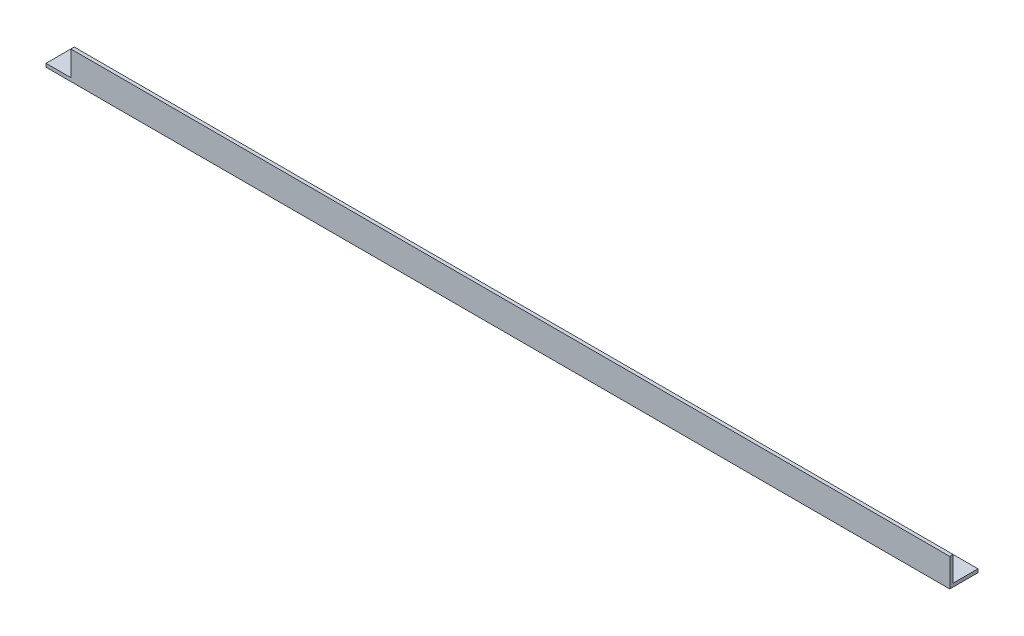
ISO-10303-21;
HEADER;
FILE_DESCRIPTION(('STEP AP214'),'2;1');
FILE_NAME('part.step','',(''),(''),'','','');
FILE_SCHEMA(('AUTOMOTIVE_DESIGN { 1 0 10303 214 1 1 1 1 }'));
ENDSEC;
DATA;
#1=APPLICATION_CONTEXT('core data for automotive mechanical design processes');
#2=APPLICATION_PROTOCOL_DEFINITION('international standard','automotive_design',2000,#1);
#3=PRODUCT_CONTEXT('',#1,'mechanical');
#4=PRODUCT('Part','Part','',(#3));
#5=PRODUCT_RELATED_PRODUCT_CATEGORY('part','',(#4));
#6=PRODUCT_DEFINITION_FORMATION('','',#4);
#7=PRODUCT_DEFINITION_CONTEXT('part definition',#1,'design');
#8=PRODUCT_DEFINITION('design','',#6,#7);
#9=PRODUCT_DEFINITION_SHAPE('','',#8);
#10=(LENGTH_UNIT() NAMED_UNIT(*) SI_UNIT(.MILLI.,.METRE.));
#11=(NAMED_UNIT(*) PLANE_ANGLE_UNIT() SI_UNIT($,.RADIAN.));
#12=(NAMED_UNIT(*) SI_UNIT($,.STERADIAN.) SOLID_ANGLE_UNIT());
#13=UNCERTAINTY_MEASURE_WITH_UNIT(LENGTH_MEASURE(1.E-05),#10,'distance_accuracy_value','');
#14=(GEOMETRIC_REPRESENTATION_CONTEXT(3) GLOBAL_UNCERTAINTY_ASSIGNED_CONTEXT((#13)) GLOBAL_UNIT_ASSIGNED_CONTEXT((#10,
#11,#12)) REPRESENTATION_CONTEXT('',''));
#15=CARTESIAN_POINT('',(0.,0.,0.));
#16=DIRECTION('',(0.,0.,1.));
#17=DIRECTION('',(1.,0.,0.));
#18=AXIS2_PLACEMENT_3D('',#15,#16,#17);
#19=CARTESIAN_POINT('',(800.,0.,-3.));
#20=DIRECTION('',(0.,0.,1.));
#21=DIRECTION('',(1.,0.,0.));
#22=AXIS2_PLACEMENT_3D('',#19,#20,#21);
#23=PLANE('',#22);
#24=DIRECTION('',(-1.,0.,0.));
#25=VECTOR('',#24,1.);
#26=CARTESIAN_POINT('',(800.,3.,-3.));
#27=LINE('',#26,#25);
#28=CARTESIAN_POINT('',(800.,3.,-3.));
#29=VERTEX_POINT('',#28);
#30=CARTESIAN_POINT('',(22.,3.,-3.));
#31=VERTEX_POINT('',#30);
#32=EDGE_CURVE('E105',#29,#31,#27,.T.);
#33=ORIENTED_EDGE('',*,*,#32,.T.);
#34=DIRECTION('',(0.,1.,0.));
#35=VECTOR('',#34,1.);
#36=CARTESIAN_POINT('',(22.,-1.22692260391814E-13,-3.));
#37=LINE('',#36,#35);
#38=CARTESIAN_POINT('',(22.,25.,-3.));
#39=VERTEX_POINT('',#38);
#40=EDGE_CURVE('E112',#31,#39,#37,.T.);
#41=ORIENTED_EDGE('',*,*,#40,.T.);
#42=DIRECTION('',(-1.,0.,0.));
#43=VECTOR('',#42,1.);
#44=CARTESIAN_POINT('',(800.,25.,-3.));
#45=LINE('',#44,#43);
#46=CARTESIAN_POINT('',(800.,25.,-3.));
#47=VERTEX_POINT('',#46);
#48=EDGE_CURVE('E11',#47,#39,#45,.T.);
#49=ORIENTED_EDGE('',*,*,#48,.F.);
#50=DIRECTION('',(0.,1.,0.));
#51=VECTOR('',#50,1.);
#52=CARTESIAN_POINT('',(800.,0.,-3.));
#53=LINE('',#52,#51);
#54=EDGE_CURVE('E78',#29,#47,#53,.T.);
#55=ORIENTED_EDGE('',*,*,#54,.F.);
#56=EDGE_LOOP('',(#33,#41,#49,#55));
#57=FACE_BOUND('',#56,.T.);
#58=ADVANCED_FACE('F34',(#57),#23,.F.);
#59=CARTESIAN_POINT('',(800.,25.,0.));
#60=DIRECTION('',(0.,1.,0.));
#61=DIRECTION('',(0.,0.,1.));
#62=AXIS2_PLACEMENT_3D('',#59,#60,#61);
#63=PLANE('',#62);
#64=DIRECTION('',(0.,0.,1.));
#65=VECTOR('',#64,1.);
#66=CARTESIAN_POINT('',(22.,25.,-25.));
#67=LINE('',#66,#65);
#68=CARTESIAN_POINT('',(22.,25.,0.));
#69=VERTEX_POINT('',#68);
#70=EDGE_CURVE('E138',#39,#69,#67,.T.);
#71=ORIENTED_EDGE('',*,*,#70,.T.);
#72=DIRECTION('',(-1.,0.,0.));
#73=VECTOR('',#72,1.);
#74=CARTESIAN_POINT('',(800.,25.,0.));
#75=LINE('',#74,#73);
#76=CARTESIAN_POINT('',(800.,25.,0.));
#77=VERTEX_POINT('',#76);
#78=EDGE_CURVE('E42',#77,#69,#75,.T.);
#79=ORIENTED_EDGE('',*,*,#78,.F.);
#80=DIRECTION('',(0.,0.,-1.));
#81=VECTOR('',#80,1.);
#82=CARTESIAN_POINT('',(800.,25.,0.));
#83=LINE('',#82,#81);
#84=EDGE_CURVE('E136',#77,#47,#83,.T.);
#85=ORIENTED_EDGE('',*,*,#84,.T.);
#86=ORIENTED_EDGE('',*,*,#48,.T.);
#87=EDGE_LOOP('',(#71,#79,#85,#86));
#88=FACE_BOUND('',#87,.T.);
#89=ADVANCED_FACE('F135',(#88),#63,.T.);
#90=CARTESIAN_POINT('',(800.,0.,0.));
#91=DIRECTION('',(0.,0.,1.));
#92=DIRECTION('',(1.,0.,0.));
#93=AXIS2_PLACEMENT_3D('',#90,#91,#92);
#94=PLANE('',#93);
#95=DIRECTION('',(0.,1.,0.));
#96=VECTOR('',#95,1.);
#97=CARTESIAN_POINT('',(22.,25.,0.));
#98=LINE('',#97,#96);
#99=CARTESIAN_POINT('',(22.,3.,0.));
#100=VERTEX_POINT('',#99);
#101=EDGE_CURVE('E129',#100,#69,#98,.T.);
#102=ORIENTED_EDGE('',*,*,#101,.F.);
#103=DIRECTION('',(1.,0.,0.));
#104=VECTOR('',#103,1.);
#105=CARTESIAN_POINT('',(0.,3.,0.));
#106=LINE('',#105,#104);
#107=CARTESIAN_POINT('',(0.,3.,0.));
#108=VERTEX_POINT('',#107);
#109=EDGE_CURVE('E149',#108,#100,#106,.T.);
#110=ORIENTED_EDGE('',*,*,#109,.F.);
#111=DIRECTION('',(0.,1.,0.));
#112=VECTOR('',#111,1.);
#113=CARTESIAN_POINT('',(0.,0.,0.));
#114=LINE('',#113,#112);
#115=CARTESIAN_POINT('',(0.,0.,0.));
#116=VERTEX_POINT('',#115);
#117=EDGE_CURVE('E109',#116,#108,#114,.T.);
#118=ORIENTED_EDGE('',*,*,#117,.F.);
#119=DIRECTION('',(-1.,0.,0.));
#120=VECTOR('',#119,1.);
#121=CARTESIAN_POINT('',(800.,0.,0.));
#122=LINE('',#121,#120);
#123=CARTESIAN_POINT('',(800.,0.,0.));
#124=VERTEX_POINT('',#123);
#125=EDGE_CURVE('E95',#124,#116,#122,.T.);
#126=ORIENTED_EDGE('',*,*,#125,.F.);
#127=DIRECTION('',(0.,1.,0.));
#128=VECTOR('',#127,1.);
#129=CARTESIAN_POINT('',(800.,0.,0.));
#130=LINE('',#129,#128);
#131=EDGE_CURVE('E101',#124,#77,#130,.T.);
#132=ORIENTED_EDGE('',*,*,#131,.T.);
#133=ORIENTED_EDGE('',*,*,#78,.T.);
#134=EDGE_LOOP('',(#102,#110,#118,#126,#132,#133));
#135=FACE_BOUND('',#134,.T.);
#136=ADVANCED_FACE('F125',(#135),#94,.T.);
#137=CARTESIAN_POINT('',(800.,0.,0.));
#138=DIRECTION('',(0.,-1.,0.));
#139=DIRECTION('',(0.,0.,-1.));
#140=AXIS2_PLACEMENT_3D('',#137,#138,#139);
#141=PLANE('',#140);
#142=DIRECTION('',(0.,0.,1.));
#143=VECTOR('',#142,1.);
#144=CARTESIAN_POINT('',(0.,0.,0.));
#145=LINE('',#144,#143);
#146=CARTESIAN_POINT('',(0.,0.,-25.));
#147=VERTEX_POINT('',#146);
#148=EDGE_CURVE('E93',#147,#116,#145,.T.);
#149=ORIENTED_EDGE('',*,*,#148,.F.);
#150=DIRECTION('',(-1.,0.,0.));
#151=VECTOR('',#150,1.);
#152=CARTESIAN_POINT('',(800.,0.,-25.));
#153=LINE('',#152,#151);
#154=CARTESIAN_POINT('',(800.,0.,-25.));
#155=VERTEX_POINT('',#154);
#156=EDGE_CURVE('E66',#155,#147,#153,.T.);
#157=ORIENTED_EDGE('',*,*,#156,.F.);
#158=DIRECTION('',(0.,0.,1.));
#159=VECTOR('',#158,1.);
#160=CARTESIAN_POINT('',(800.,0.,0.));
#161=LINE('',#160,#159);
#162=EDGE_CURVE('E91',#155,#124,#161,.T.);
#163=ORIENTED_EDGE('',*,*,#162,.T.);
#164=ORIENTED_EDGE('',*,*,#125,.T.);
#165=EDGE_LOOP('',(#149,#157,#163,#164));
#166=FACE_BOUND('',#165,.T.);
#167=ADVANCED_FACE('F90',(#166),#141,.T.);
#168=CARTESIAN_POINT('',(800.,3.,-25.));
#169=DIRECTION('',(0.,0.,-1.));
#170=DIRECTION('',(-1.,0.,0.));
#171=AXIS2_PLACEMENT_3D('',#168,#169,#170);
#172=PLANE('',#171);
#173=DIRECTION('',(0.,-1.,0.));
#174=VECTOR('',#173,1.);
#175=CARTESIAN_POINT('',(0.,3.,-25.));
#176=LINE('',#175,#174);
#177=CARTESIAN_POINT('',(0.,3.,-25.));
#178=VERTEX_POINT('',#177);
#179=EDGE_CURVE('E114',#178,#147,#176,.T.);
#180=ORIENTED_EDGE('',*,*,#179,.F.);
#181=DIRECTION('',(-1.,0.,0.));
#182=VECTOR('',#181,1.);
#183=CARTESIAN_POINT('',(800.,3.,-25.));
#184=LINE('',#183,#182);
#185=CARTESIAN_POINT('',(800.,3.,-25.));
#186=VERTEX_POINT('',#185);
#187=EDGE_CURVE('E72',#186,#178,#184,.T.);
#188=ORIENTED_EDGE('',*,*,#187,.F.);
#189=DIRECTION('',(0.,-1.,0.));
#190=VECTOR('',#189,1.);
#191=CARTESIAN_POINT('',(800.,3.,-25.));
#192=LINE('',#191,#190);
#193=EDGE_CURVE('E99',#186,#155,#192,.T.);
#194=ORIENTED_EDGE('',*,*,#193,.T.);
#195=ORIENTED_EDGE('',*,*,#156,.T.);
#196=EDGE_LOOP('',(#180,#188,#194,#195));
#197=FACE_BOUND('',#196,.T.);
#198=ADVANCED_FACE('F103',(#197),#172,.T.);
#199=CARTESIAN_POINT('',(800.,3.,0.));
#200=DIRECTION('',(0.,-1.,0.));
#201=DIRECTION('',(0.,0.,-1.));
#202=AXIS2_PLACEMENT_3D('',#199,#200,#201);
#203=PLANE('',#202);
#204=ORIENTED_EDGE('',*,*,#187,.T.);
#205=DIRECTION('',(0.,0.,-1.));
#206=VECTOR('',#205,1.);
#207=CARTESIAN_POINT('',(0.,3.,0.));
#208=LINE('',#207,#206);
#209=EDGE_CURVE('E116',#178,#108,#208,.F.);
#210=ORIENTED_EDGE('',*,*,#209,.T.);
#211=ORIENTED_EDGE('',*,*,#109,.T.);
#212=DIRECTION('',(0.,0.,1.));
#213=VECTOR('',#212,1.);
#214=CARTESIAN_POINT('',(22.,3.,-25.));
#215=LINE('',#214,#213);
#216=EDGE_CURVE('E144',#31,#100,#215,.T.);
#217=ORIENTED_EDGE('',*,*,#216,.F.);
#218=ORIENTED_EDGE('',*,*,#32,.F.);
#219=DIRECTION('',(0.,0.,-1.));
#220=VECTOR('',#219,1.);
#221=CARTESIAN_POINT('',(800.,3.,0.));
#222=LINE('',#221,#220);
#223=EDGE_CURVE('E50',#186,#29,#222,.F.);
#224=ORIENTED_EDGE('',*,*,#223,.F.);
#225=EDGE_LOOP('',(#204,#210,#211,#217,#218,#224));
#226=FACE_BOUND('',#225,.T.);
#227=ADVANCED_FACE('F152',(#226),#203,.F.);
#228=CARTESIAN_POINT('',(800.,0.,0.));
#229=DIRECTION('',(-1.,0.,0.));
#230=DIRECTION('',(0.,0.,1.));
#231=AXIS2_PLACEMENT_3D('',#228,#229,#230);
#232=PLANE('',#231);
#233=ORIENTED_EDGE('',*,*,#54,.T.);
#234=ORIENTED_EDGE('',*,*,#84,.F.);
#235=ORIENTED_EDGE('',*,*,#131,.F.);
#236=ORIENTED_EDGE('',*,*,#162,.F.);
#237=ORIENTED_EDGE('',*,*,#193,.F.);
#238=ORIENTED_EDGE('',*,*,#223,.T.);
#239=EDGE_LOOP('',(#233,#234,#235,#236,#237,#238));
#240=FACE_BOUND('',#239,.T.);
#241=ADVANCED_FACE('F98',(#240),#232,.F.);
#242=CARTESIAN_POINT('',(0.,0.,0.));
#243=DIRECTION('',(-1.,0.,0.));
#244=DIRECTION('',(0.,0.,1.));
#245=AXIS2_PLACEMENT_3D('',#242,#243,#244);
#246=PLANE('',#245);
#247=ORIENTED_EDGE('',*,*,#117,.T.);
#248=ORIENTED_EDGE('',*,*,#209,.F.);
#249=ORIENTED_EDGE('',*,*,#179,.T.);
#250=ORIENTED_EDGE('',*,*,#148,.T.);
#251=EDGE_LOOP('',(#247,#248,#249,#250));
#252=FACE_BOUND('',#251,.T.);
#253=ADVANCED_FACE('F158',(#252),#246,.T.);
#254=CARTESIAN_POINT('',(22.,25.,-25.));
#255=DIRECTION('',(1.,0.,0.));
#256=DIRECTION('',(0.,1.,0.));
#257=AXIS2_PLACEMENT_3D('',#254,#255,#256);
#258=PLANE('',#257);
#259=ORIENTED_EDGE('',*,*,#216,.T.);
#260=ORIENTED_EDGE('',*,*,#101,.T.);
#261=ORIENTED_EDGE('',*,*,#70,.F.);
#262=ORIENTED_EDGE('',*,*,#40,.F.);
#263=EDGE_LOOP('',(#259,#260,#261,#262));
#264=FACE_BOUND('',#263,.T.);
#265=ADVANCED_FACE('F160',(#264),#258,.F.);
#266=CLOSED_SHELL('',(#58,#89,#136,#167,#198,#227,#241,#253,#265));
#267=MANIFOLD_SOLID_BREP('B2',#266);
#268=ADVANCED_BREP_SHAPE_REPRESENTATION('',(#18,#267),#14);
#269=SHAPE_DEFINITION_REPRESENTATION(#9,#268);
ENDSEC;
END-ISO-10303-21;
